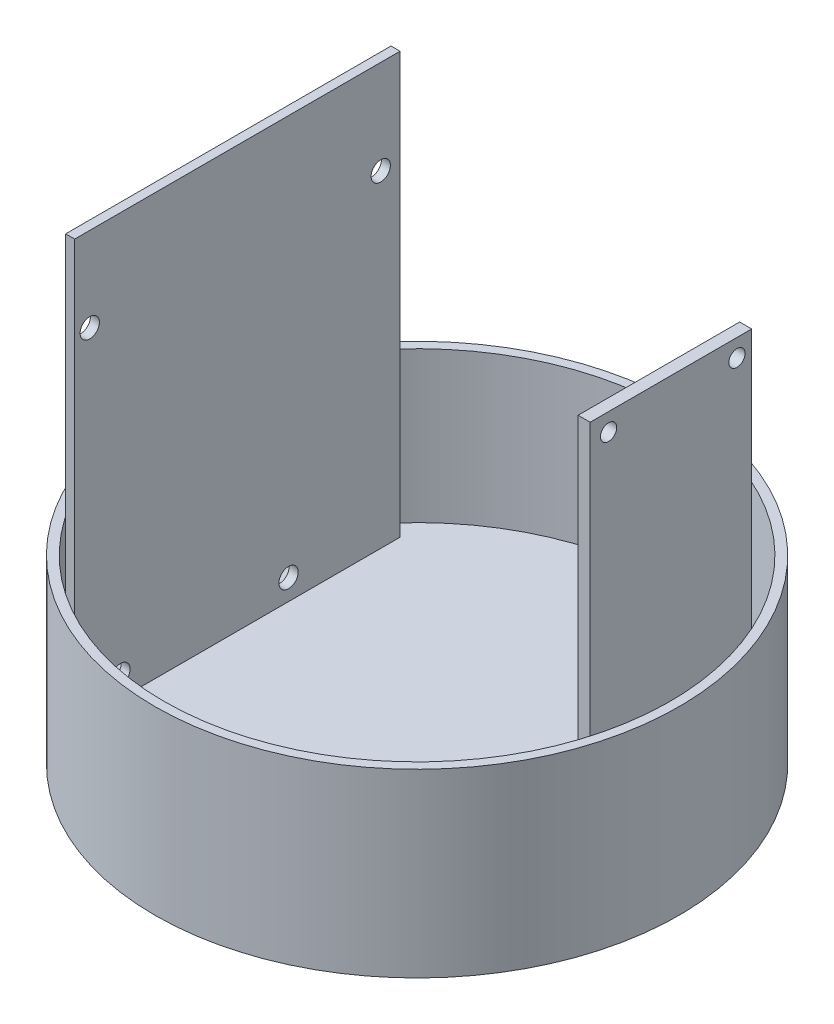
ISO-10303-21;
HEADER;
FILE_DESCRIPTION(('STEP AP214'),'2;1');
FILE_NAME('part.step','',(''),(''),'','','');
FILE_SCHEMA(('AUTOMOTIVE_DESIGN { 1 0 10303 214 1 1 1 1 }'));
ENDSEC;
DATA;
#1=APPLICATION_CONTEXT('core data for automotive mechanical design processes');
#2=APPLICATION_PROTOCOL_DEFINITION('international standard','automotive_design',2000,#1);
#3=PRODUCT_CONTEXT('',#1,'mechanical');
#4=PRODUCT('Part','Part','',(#3));
#5=PRODUCT_RELATED_PRODUCT_CATEGORY('part','',(#4));
#6=PRODUCT_DEFINITION_FORMATION('','',#4);
#7=PRODUCT_DEFINITION_CONTEXT('part definition',#1,'design');
#8=PRODUCT_DEFINITION('design','',#6,#7);
#9=PRODUCT_DEFINITION_SHAPE('','',#8);
#10=(LENGTH_UNIT() NAMED_UNIT(*) SI_UNIT(.MILLI.,.METRE.));
#11=(NAMED_UNIT(*) PLANE_ANGLE_UNIT() SI_UNIT($,.RADIAN.));
#12=(NAMED_UNIT(*) SI_UNIT($,.STERADIAN.) SOLID_ANGLE_UNIT());
#13=UNCERTAINTY_MEASURE_WITH_UNIT(LENGTH_MEASURE(1.E-05),#10,'distance_accuracy_value','');
#14=(GEOMETRIC_REPRESENTATION_CONTEXT(3) GLOBAL_UNCERTAINTY_ASSIGNED_CONTEXT((#13)) GLOBAL_UNIT_ASSIGNED_CONTEXT((#10,
#11,#12)) REPRESENTATION_CONTEXT('',''));
#15=CARTESIAN_POINT('',(0.,0.,0.));
#16=DIRECTION('',(0.,0.,1.));
#17=DIRECTION('',(1.,0.,0.));
#18=AXIS2_PLACEMENT_3D('',#15,#16,#17);
#19=CARTESIAN_POINT('',(0.,4.99999999999999,0.));
#20=DIRECTION('',(0.,1.,0.));
#21=DIRECTION('',(0.,0.,1.));
#22=AXIS2_PLACEMENT_3D('',#19,#20,#21);
#23=PLANE('',#22);
#24=DIRECTION('',(0.,0.,-1.));
#25=VECTOR('',#24,1.);
#26=CARTESIAN_POINT('',(30.9383053559725,4.99999999999999,-24.6003340299148));
#27=LINE('',#26,#25);
#28=CARTESIAN_POINT('',(30.9383053559726,4.99999999999999,2.20655244063472));
#29=VERTEX_POINT('',#28);
#30=CARTESIAN_POINT('',(30.9383053559725,4.99999999999999,-24.6003340299148));
#31=VERTEX_POINT('',#30);
#32=EDGE_CURVE('E144',#29,#31,#27,.T.);
#33=ORIENTED_EDGE('',*,*,#32,.F.);
#34=DIRECTION('',(-1.,0.,0.));
#35=VECTOR('',#34,1.);
#36=CARTESIAN_POINT('',(43.501,4.99999999999999,2.20655244063472));
#37=LINE('',#36,#35);
#38=CARTESIAN_POINT('',(28.9383053559725,4.99999999999999,2.20655244063472));
#39=VERTEX_POINT('',#38);
#40=EDGE_CURVE('E120',#29,#39,#37,.T.);
#41=ORIENTED_EDGE('',*,*,#40,.T.);
#42=DIRECTION('',(0.,0.,1.));
#43=VECTOR('',#42,1.);
#44=CARTESIAN_POINT('',(28.9383053559725,4.99999999999999,-24.6003340299148));
#45=LINE('',#44,#43);
#46=CARTESIAN_POINT('',(28.9383053559725,4.99999999999999,-24.6003340299148));
#47=VERTEX_POINT('',#46);
#48=EDGE_CURVE('E128',#47,#39,#45,.T.);
#49=ORIENTED_EDGE('',*,*,#48,.F.);
#50=DIRECTION('',(-1.,0.,0.));
#51=VECTOR('',#50,1.);
#52=CARTESIAN_POINT('',(30.9383053559725,4.99999999999999,-24.6003340299148));
#53=LINE('',#52,#51);
#54=EDGE_CURVE('E147',#31,#47,#53,.T.);
#55=ORIENTED_EDGE('',*,*,#54,.F.);
#56=EDGE_LOOP('',(#33,#41,#49,#55));
#57=FACE_BOUND('',#56,.T.);
#58=CARTESIAN_POINT('',(0.,4.99999999999999,0.));
#59=DIRECTION('',(0.,1.,0.));
#60=DIRECTION('',(0.,0.,1.));
#61=AXIS2_PLACEMENT_3D('',#58,#59,#60);
#62=CIRCLE('',#61,42.);
#63=CARTESIAN_POINT('',(0.,4.99999999999999,42.));
#64=VERTEX_POINT('',#63);
#65=EDGE_CURVE('E232',#64,#64,#62,.T.);
#66=ORIENTED_EDGE('',*,*,#65,.T.);
#67=EDGE_LOOP('',(#66));
#68=FACE_BOUND('',#67,.T.);
#69=DIRECTION('',(1.,0.,0.));
#70=VECTOR('',#69,1.);
#71=CARTESIAN_POINT('',(-30.5050252601889,4.99999999999999,27.8201260331686));
#72=LINE('',#71,#70);
#73=CARTESIAN_POINT('',(-30.5050252601889,4.99999999999999,27.8201260331686));
#74=VERTEX_POINT('',#73);
#75=CARTESIAN_POINT('',(-29.0050252601889,4.99999999999999,27.8201260331686));
#76=VERTEX_POINT('',#75);
#77=EDGE_CURVE('E208',#74,#76,#72,.T.);
#78=ORIENTED_EDGE('',*,*,#77,.F.);
#79=DIRECTION('',(0.,0.,1.));
#80=VECTOR('',#79,1.);
#81=CARTESIAN_POINT('',(-30.5050252601889,4.99999999999999,-26.1798739668314));
#82=LINE('',#81,#80);
#83=CARTESIAN_POINT('',(-30.5050252601889,4.99999999999999,-26.1798739668314));
#84=VERTEX_POINT('',#83);
#85=EDGE_CURVE('E204',#84,#74,#82,.T.);
#86=ORIENTED_EDGE('',*,*,#85,.F.);
#87=DIRECTION('',(-1.,0.,0.));
#88=VECTOR('',#87,1.);
#89=CARTESIAN_POINT('',(-30.5050252601889,4.99999999999999,-26.1798739668314));
#90=LINE('',#89,#88);
#91=CARTESIAN_POINT('',(-29.0050252601889,4.99999999999999,-26.1798739668314));
#92=VERTEX_POINT('',#91);
#93=EDGE_CURVE('E216',#92,#84,#90,.T.);
#94=ORIENTED_EDGE('',*,*,#93,.F.);
#95=DIRECTION('',(0.,0.,-1.));
#96=VECTOR('',#95,1.);
#97=CARTESIAN_POINT('',(-29.0050252601889,4.99999999999999,-26.1798739668314));
#98=LINE('',#97,#96);
#99=EDGE_CURVE('E212',#76,#92,#98,.T.);
#100=ORIENTED_EDGE('',*,*,#99,.F.);
#101=EDGE_LOOP('',(#78,#86,#94,#100));
#102=FACE_BOUND('',#101,.T.);
#103=ADVANCED_FACE('F45',(#57,#68,#102),#23,.T.);
#104=CARTESIAN_POINT('',(0.,30.,0.));
#105=DIRECTION('',(0.,-1.,0.));
#106=DIRECTION('',(0.,0.,-1.));
#107=AXIS2_PLACEMENT_3D('',#104,#105,#106);
#108=CYLINDRICAL_SURFACE('',#107,43.5);
#109=CARTESIAN_POINT('',(0.,30.,0.));
#110=DIRECTION('',(0.,1.,0.));
#111=DIRECTION('',(0.,0.,1.));
#112=AXIS2_PLACEMENT_3D('',#109,#110,#111);
#113=CIRCLE('',#112,43.5);
#114=CARTESIAN_POINT('',(0.,30.,43.5));
#115=VERTEX_POINT('',#114);
#116=EDGE_CURVE('E11',#115,#115,#113,.T.);
#117=ORIENTED_EDGE('',*,*,#116,.F.);
#118=EDGE_LOOP('',(#117));
#119=FACE_BOUND('',#118,.T.);
#120=CARTESIAN_POINT('',(0.,0.,0.));
#121=DIRECTION('',(0.,1.,0.));
#122=DIRECTION('',(0.,0.,1.));
#123=AXIS2_PLACEMENT_3D('',#120,#121,#122);
#124=CIRCLE('',#123,43.5);
#125=CARTESIAN_POINT('',(0.,0.,43.5));
#126=VERTEX_POINT('',#125);
#127=EDGE_CURVE('E55',#126,#126,#124,.T.);
#128=ORIENTED_EDGE('',*,*,#127,.T.);
#129=EDGE_LOOP('',(#128));
#130=FACE_BOUND('',#129,.T.);
#131=ADVANCED_FACE('F47',(#119,#130),#108,.T.);
#132=CARTESIAN_POINT('',(0.,30.,0.));
#133=DIRECTION('',(0.,1.,0.));
#134=DIRECTION('',(0.,0.,1.));
#135=AXIS2_PLACEMENT_3D('',#132,#133,#134);
#136=PLANE('',#135);
#137=CARTESIAN_POINT('',(0.,30.,0.));
#138=DIRECTION('',(0.,1.,0.));
#139=DIRECTION('',(0.,0.,1.));
#140=AXIS2_PLACEMENT_3D('',#137,#138,#139);
#141=CIRCLE('',#140,42.);
#142=CARTESIAN_POINT('',(0.,30.,42.));
#143=VERTEX_POINT('',#142);
#144=EDGE_CURVE('E49',#143,#143,#141,.T.);
#145=ORIENTED_EDGE('',*,*,#144,.F.);
#146=EDGE_LOOP('',(#145));
#147=FACE_BOUND('',#146,.T.);
#148=ORIENTED_EDGE('',*,*,#116,.T.);
#149=EDGE_LOOP('',(#148));
#150=FACE_BOUND('',#149,.T.);
#151=ADVANCED_FACE('F246',(#147,#150),#136,.T.);
#152=CARTESIAN_POINT('',(0.,0.,0.));
#153=DIRECTION('',(0.,1.,0.));
#154=DIRECTION('',(0.,0.,1.));
#155=AXIS2_PLACEMENT_3D('',#152,#153,#154);
#156=PLANE('',#155);
#157=ORIENTED_EDGE('',*,*,#127,.F.);
#158=EDGE_LOOP('',(#157));
#159=FACE_BOUND('',#158,.T.);
#160=ADVANCED_FACE('F249',(#159),#156,.F.);
#161=CARTESIAN_POINT('',(0.,4.99999999999999,0.));
#162=DIRECTION('',(0.,1.,0.));
#163=DIRECTION('',(0.,0.,1.));
#164=AXIS2_PLACEMENT_3D('',#161,#162,#163);
#165=CYLINDRICAL_SURFACE('',#164,42.);
#166=ORIENTED_EDGE('',*,*,#144,.T.);
#167=EDGE_LOOP('',(#166));
#168=FACE_BOUND('',#167,.T.);
#169=ORIENTED_EDGE('',*,*,#65,.F.);
#170=EDGE_LOOP('',(#169));
#171=FACE_BOUND('',#170,.T.);
#172=ADVANCED_FACE('F243',(#168,#171),#165,.F.);
#173=CARTESIAN_POINT('',(-30.5050252601889,85.,-26.1798739668314));
#174=DIRECTION('',(1.,0.,0.));
#175=DIRECTION('',(0.,0.,-1.));
#176=AXIS2_PLACEMENT_3D('',#173,#174,#175);
#177=PLANE('',#176);
#178=CARTESIAN_POINT('',(-30.5050252601889,60.8606572002365,25.3201260331693));
#179=DIRECTION('',(1.,0.,0.));
#180=DIRECTION('',(0.,0.,-1.));
#181=AXIS2_PLACEMENT_3D('',#178,#179,#180);
#182=CIRCLE('',#181,1.6);
#183=CARTESIAN_POINT('',(-30.5050252601889,60.8606572002365,23.7201260331694));
#184=VERTEX_POINT('',#183);
#185=EDGE_CURVE('E165',#184,#184,#182,.F.);
#186=ORIENTED_EDGE('',*,*,#185,.F.);
#187=EDGE_LOOP('',(#186));
#188=FACE_BOUND('',#187,.T.);
#189=CARTESIAN_POINT('',(-30.5050252601889,59.2606572002372,-22.9798739668307));
#190=DIRECTION('',(1.,0.,0.));
#191=DIRECTION('',(0.,0.,-1.));
#192=AXIS2_PLACEMENT_3D('',#189,#190,#191);
#193=CIRCLE('',#192,1.6);
#194=CARTESIAN_POINT('',(-30.5050252601889,59.2606572002372,-24.5798739668307));
#195=VERTEX_POINT('',#194);
#196=EDGE_CURVE('E170',#195,#195,#193,.F.);
#197=ORIENTED_EDGE('',*,*,#196,.F.);
#198=EDGE_LOOP('',(#197));
#199=FACE_BOUND('',#198,.T.);
#200=CARTESIAN_POINT('',(-30.5050252601889,8.46065720023696,-7.67987396683139));
#201=DIRECTION('',(1.,0.,0.));
#202=DIRECTION('',(0.,0.,-1.));
#203=AXIS2_PLACEMENT_3D('',#200,#201,#202);
#204=CIRCLE('',#203,1.59999999999999);
#205=CARTESIAN_POINT('',(-30.5050252601889,8.46065720023696,-9.27987396683138));
#206=VERTEX_POINT('',#205);
#207=EDGE_CURVE('E174',#206,#206,#204,.F.);
#208=ORIENTED_EDGE('',*,*,#207,.F.);
#209=EDGE_LOOP('',(#208));
#210=FACE_BOUND('',#209,.T.);
#211=CARTESIAN_POINT('',(-30.5050252601889,8.46065720023656,20.2201260331686));
#212=DIRECTION('',(1.,0.,0.));
#213=DIRECTION('',(0.,0.,-1.));
#214=AXIS2_PLACEMENT_3D('',#211,#212,#213);
#215=CIRCLE('',#214,1.59999999999999);
#216=CARTESIAN_POINT('',(-30.5050252601889,8.46065720023656,18.6201260331686));
#217=VERTEX_POINT('',#216);
#218=EDGE_CURVE('E182',#217,#217,#215,.F.);
#219=ORIENTED_EDGE('',*,*,#218,.F.);
#220=EDGE_LOOP('',(#219));
#221=FACE_BOUND('',#220,.T.);
#222=DIRECTION('',(0.,-1.,0.));
#223=VECTOR('',#222,1.);
#224=CARTESIAN_POINT('',(-30.5050252601889,85.,27.8201260331686));
#225=LINE('',#224,#223);
#226=CARTESIAN_POINT('',(-30.5050252601889,74.8606572002371,27.8201260331686));
#227=VERTEX_POINT('',#226);
#228=EDGE_CURVE('E229',#227,#74,#225,.T.);
#229=ORIENTED_EDGE('',*,*,#228,.F.);
#230=DIRECTION('',(0.,0.,-1.));
#231=VECTOR('',#230,1.);
#232=CARTESIAN_POINT('',(-30.5050252601889,74.8606572002371,-26.1798739668314));
#233=LINE('',#232,#231);
#234=CARTESIAN_POINT('',(-30.5050252601889,74.8606572002371,-26.1798739668314));
#235=VERTEX_POINT('',#234);
#236=EDGE_CURVE('E198',#227,#235,#233,.T.);
#237=ORIENTED_EDGE('',*,*,#236,.T.);
#238=DIRECTION('',(0.,-1.,0.));
#239=VECTOR('',#238,1.);
#240=CARTESIAN_POINT('',(-30.5050252601889,85.,-26.1798739668314));
#241=LINE('',#240,#239);
#242=EDGE_CURVE('E220',#235,#84,#241,.T.);
#243=ORIENTED_EDGE('',*,*,#242,.T.);
#244=ORIENTED_EDGE('',*,*,#85,.T.);
#245=EDGE_LOOP('',(#229,#237,#243,#244));
#246=FACE_BOUND('',#245,.T.);
#247=ADVANCED_FACE('F268',(#188,#199,#210,#221,#246),#177,.F.);
#248=CARTESIAN_POINT('',(-30.5050252601889,85.,27.8201260331686));
#249=DIRECTION('',(0.,0.,-1.));
#250=DIRECTION('',(-1.,0.,0.));
#251=AXIS2_PLACEMENT_3D('',#248,#249,#250);
#252=PLANE('',#251);
#253=DIRECTION('',(0.,-1.,0.));
#254=VECTOR('',#253,1.);
#255=CARTESIAN_POINT('',(-29.0050252601889,85.,27.8201260331686));
#256=LINE('',#255,#254);
#257=CARTESIAN_POINT('',(-29.0050252601889,74.8606572002371,27.8201260331686));
#258=VERTEX_POINT('',#257);
#259=EDGE_CURVE('E226',#258,#76,#256,.T.);
#260=ORIENTED_EDGE('',*,*,#259,.F.);
#261=DIRECTION('',(1.,0.,0.));
#262=VECTOR('',#261,1.);
#263=CARTESIAN_POINT('',(-43.5,74.8606572002371,27.8201260331686));
#264=LINE('',#263,#262);
#265=EDGE_CURVE('E194',#227,#258,#264,.T.);
#266=ORIENTED_EDGE('',*,*,#265,.F.);
#267=ORIENTED_EDGE('',*,*,#228,.T.);
#268=ORIENTED_EDGE('',*,*,#77,.T.);
#269=EDGE_LOOP('',(#260,#266,#267,#268));
#270=FACE_BOUND('',#269,.T.);
#271=ADVANCED_FACE('F289',(#270),#252,.F.);
#272=CARTESIAN_POINT('',(-29.0050252601889,85.,-26.1798739668314));
#273=DIRECTION('',(-1.,0.,0.));
#274=DIRECTION('',(0.,0.,1.));
#275=AXIS2_PLACEMENT_3D('',#272,#273,#274);
#276=PLANE('',#275);
#277=CARTESIAN_POINT('',(-29.0050252601889,60.8606572002365,25.3201260331693));
#278=DIRECTION('',(1.,0.,0.));
#279=DIRECTION('',(0.,0.,-1.));
#280=AXIS2_PLACEMENT_3D('',#277,#278,#279);
#281=CIRCLE('',#280,1.6);
#282=CARTESIAN_POINT('',(-29.0050252601889,60.8606572002365,23.7201260331693));
#283=VERTEX_POINT('',#282);
#284=EDGE_CURVE('E161',#283,#283,#281,.T.);
#285=ORIENTED_EDGE('',*,*,#284,.F.);
#286=EDGE_LOOP('',(#285));
#287=FACE_BOUND('',#286,.T.);
#288=CARTESIAN_POINT('',(-29.0050252601889,59.2606572002372,-22.9798739668307));
#289=DIRECTION('',(1.,0.,0.));
#290=DIRECTION('',(0.,0.,-1.));
#291=AXIS2_PLACEMENT_3D('',#288,#289,#290);
#292=CIRCLE('',#291,1.6);
#293=CARTESIAN_POINT('',(-29.0050252601889,59.2606572002372,-24.5798739668307));
#294=VERTEX_POINT('',#293);
#295=EDGE_CURVE('E166',#294,#294,#292,.T.);
#296=ORIENTED_EDGE('',*,*,#295,.F.);
#297=EDGE_LOOP('',(#296));
#298=FACE_BOUND('',#297,.T.);
#299=CARTESIAN_POINT('',(-29.0050252601889,8.46065720023696,-7.67987396683139));
#300=DIRECTION('',(1.,0.,0.));
#301=DIRECTION('',(0.,0.,-1.));
#302=AXIS2_PLACEMENT_3D('',#299,#300,#301);
#303=CIRCLE('',#302,1.59999999999999);
#304=CARTESIAN_POINT('',(-29.0050252601889,8.46065720023696,-9.27987396683138));
#305=VERTEX_POINT('',#304);
#306=EDGE_CURVE('E178',#305,#305,#303,.T.);
#307=ORIENTED_EDGE('',*,*,#306,.F.);
#308=EDGE_LOOP('',(#307));
#309=FACE_BOUND('',#308,.T.);
#310=CARTESIAN_POINT('',(-29.0050252601889,8.46065720023656,20.2201260331686));
#311=DIRECTION('',(1.,0.,0.));
#312=DIRECTION('',(0.,0.,-1.));
#313=AXIS2_PLACEMENT_3D('',#310,#311,#312);
#314=CIRCLE('',#313,1.59999999999999);
#315=CARTESIAN_POINT('',(-29.0050252601889,8.46065720023656,18.6201260331686));
#316=VERTEX_POINT('',#315);
#317=EDGE_CURVE('E160',#316,#316,#314,.T.);
#318=ORIENTED_EDGE('',*,*,#317,.F.);
#319=EDGE_LOOP('',(#318));
#320=FACE_BOUND('',#319,.T.);
#321=DIRECTION('',(0.,-1.,0.));
#322=VECTOR('',#321,1.);
#323=CARTESIAN_POINT('',(-29.0050252601889,85.,-26.1798739668314));
#324=LINE('',#323,#322);
#325=CARTESIAN_POINT('',(-29.0050252601889,74.8606572002371,-26.1798739668314));
#326=VERTEX_POINT('',#325);
#327=EDGE_CURVE('E223',#326,#92,#324,.T.);
#328=ORIENTED_EDGE('',*,*,#327,.F.);
#329=DIRECTION('',(0.,0.,-1.));
#330=VECTOR('',#329,1.);
#331=CARTESIAN_POINT('',(-29.0050252601889,74.8606572002371,27.8201260331686));
#332=LINE('',#331,#330);
#333=EDGE_CURVE('E71',#258,#326,#332,.T.);
#334=ORIENTED_EDGE('',*,*,#333,.F.);
#335=ORIENTED_EDGE('',*,*,#259,.T.);
#336=ORIENTED_EDGE('',*,*,#99,.T.);
#337=EDGE_LOOP('',(#328,#334,#335,#336));
#338=FACE_BOUND('',#337,.T.);
#339=ADVANCED_FACE('F293',(#287,#298,#309,#320,#338),#276,.F.);
#340=CARTESIAN_POINT('',(-30.5050252601889,85.,-26.1798739668314));
#341=DIRECTION('',(0.,0.,1.));
#342=DIRECTION('',(1.,0.,0.));
#343=AXIS2_PLACEMENT_3D('',#340,#341,#342);
#344=PLANE('',#343);
#345=ORIENTED_EDGE('',*,*,#242,.F.);
#346=DIRECTION('',(1.,0.,0.));
#347=VECTOR('',#346,1.);
#348=CARTESIAN_POINT('',(-43.5,74.8606572002371,-26.1798739668314));
#349=LINE('',#348,#347);
#350=EDGE_CURVE('E195',#235,#326,#349,.T.);
#351=ORIENTED_EDGE('',*,*,#350,.T.);
#352=ORIENTED_EDGE('',*,*,#327,.T.);
#353=ORIENTED_EDGE('',*,*,#93,.T.);
#354=EDGE_LOOP('',(#345,#351,#352,#353));
#355=FACE_BOUND('',#354,.T.);
#356=ADVANCED_FACE('F299',(#355),#344,.F.);
#357=CARTESIAN_POINT('',(-43.5,74.8606572002371,27.8201260331686));
#358=DIRECTION('',(0.,-1.,0.));
#359=DIRECTION('',(0.,0.,-1.));
#360=AXIS2_PLACEMENT_3D('',#357,#358,#359);
#361=PLANE('',#360);
#362=ORIENTED_EDGE('',*,*,#265,.T.);
#363=ORIENTED_EDGE('',*,*,#333,.T.);
#364=ORIENTED_EDGE('',*,*,#350,.F.);
#365=ORIENTED_EDGE('',*,*,#236,.F.);
#366=EDGE_LOOP('',(#362,#363,#364,#365));
#367=FACE_BOUND('',#366,.T.);
#368=ADVANCED_FACE('F303',(#367),#361,.F.);
#369=CARTESIAN_POINT('',(-43.501,8.46065720023656,20.2201260331686));
#370=DIRECTION('',(1.,0.,0.));
#371=DIRECTION('',(0.,0.,-1.));
#372=AXIS2_PLACEMENT_3D('',#369,#370,#371);
#373=CYLINDRICAL_SURFACE('',#372,1.59999999999999);
#374=ORIENTED_EDGE('',*,*,#317,.T.);
#375=EDGE_LOOP('',(#374));
#376=FACE_BOUND('',#375,.T.);
#377=ORIENTED_EDGE('',*,*,#218,.T.);
#378=EDGE_LOOP('',(#377));
#379=FACE_BOUND('',#378,.T.);
#380=ADVANCED_FACE('F312',(#376,#379),#373,.F.);
#381=CARTESIAN_POINT('',(-43.501,8.46065720023696,-7.67987396683139));
#382=DIRECTION('',(1.,0.,0.));
#383=DIRECTION('',(0.,0.,-1.));
#384=AXIS2_PLACEMENT_3D('',#381,#382,#383);
#385=CYLINDRICAL_SURFACE('',#384,1.59999999999999);
#386=ORIENTED_EDGE('',*,*,#306,.T.);
#387=EDGE_LOOP('',(#386));
#388=FACE_BOUND('',#387,.T.);
#389=ORIENTED_EDGE('',*,*,#207,.T.);
#390=EDGE_LOOP('',(#389));
#391=FACE_BOUND('',#390,.T.);
#392=ADVANCED_FACE('F333',(#388,#391),#385,.F.);
#393=CARTESIAN_POINT('',(-43.501,59.2606572002372,-22.9798739668307));
#394=DIRECTION('',(1.,0.,0.));
#395=DIRECTION('',(0.,0.,-1.));
#396=AXIS2_PLACEMENT_3D('',#393,#394,#395);
#397=CYLINDRICAL_SURFACE('',#396,1.6);
#398=ORIENTED_EDGE('',*,*,#295,.T.);
#399=EDGE_LOOP('',(#398));
#400=FACE_BOUND('',#399,.T.);
#401=ORIENTED_EDGE('',*,*,#196,.T.);
#402=EDGE_LOOP('',(#401));
#403=FACE_BOUND('',#402,.T.);
#404=ADVANCED_FACE('F342',(#400,#403),#397,.F.);
#405=CARTESIAN_POINT('',(-43.501,60.8606572002365,25.3201260331693));
#406=DIRECTION('',(1.,0.,0.));
#407=DIRECTION('',(0.,0.,-1.));
#408=AXIS2_PLACEMENT_3D('',#405,#406,#407);
#409=CYLINDRICAL_SURFACE('',#408,1.6);
#410=ORIENTED_EDGE('',*,*,#284,.T.);
#411=EDGE_LOOP('',(#410));
#412=FACE_BOUND('',#411,.T.);
#413=ORIENTED_EDGE('',*,*,#185,.T.);
#414=EDGE_LOOP('',(#413));
#415=FACE_BOUND('',#414,.T.);
#416=ADVANCED_FACE('F351',(#412,#415),#409,.F.);
#417=CARTESIAN_POINT('',(30.9383053559725,72.,-24.6003340299148));
#418=DIRECTION('',(-1.,0.,0.));
#419=DIRECTION('',(0.,0.,1.));
#420=AXIS2_PLACEMENT_3D('',#417,#418,#419);
#421=PLANE('',#420);
#422=CARTESIAN_POINT('',(30.9383053559725,62.7500000000001,-0.850334029914798));
#423=DIRECTION('',(-1.,0.,0.));
#424=DIRECTION('',(0.,0.,1.));
#425=AXIS2_PLACEMENT_3D('',#422,#423,#424);
#426=CIRCLE('',#425,1.35000000000001);
#427=CARTESIAN_POINT('',(30.9383053559725,62.7500000000001,0.499665970085209));
#428=VERTEX_POINT('',#427);
#429=EDGE_CURVE('E457',#428,#428,#426,.F.);
#430=ORIENTED_EDGE('',*,*,#429,.F.);
#431=EDGE_LOOP('',(#430));
#432=FACE_BOUND('',#431,.T.);
#433=CARTESIAN_POINT('',(30.9383053559725,7.45000000000009,-22.1503340299148));
#434=DIRECTION('',(-1.,0.,0.));
#435=DIRECTION('',(0.,0.,1.));
#436=AXIS2_PLACEMENT_3D('',#433,#434,#435);
#437=CIRCLE('',#436,1.35);
#438=CARTESIAN_POINT('',(30.9383053559725,7.45000000000009,-20.8003340299148));
#439=VERTEX_POINT('',#438);
#440=EDGE_CURVE('E461',#439,#439,#437,.F.);
#441=ORIENTED_EDGE('',*,*,#440,.F.);
#442=EDGE_LOOP('',(#441));
#443=FACE_BOUND('',#442,.T.);
#444=CARTESIAN_POINT('',(30.9383053559725,7.45000000000009,-0.850334029914798));
#445=DIRECTION('',(-1.,0.,0.));
#446=DIRECTION('',(0.,0.,1.));
#447=AXIS2_PLACEMENT_3D('',#444,#445,#446);
#448=CIRCLE('',#447,1.35);
#449=CARTESIAN_POINT('',(30.9383053559725,7.45000000000009,0.499665970085205));
#450=VERTEX_POINT('',#449);
#451=EDGE_CURVE('E465',#450,#450,#448,.F.);
#452=ORIENTED_EDGE('',*,*,#451,.F.);
#453=EDGE_LOOP('',(#452));
#454=FACE_BOUND('',#453,.T.);
#455=CARTESIAN_POINT('',(30.9383053559725,62.7500000000001,-22.1503340299148));
#456=DIRECTION('',(-1.,0.,0.));
#457=DIRECTION('',(0.,0.,1.));
#458=AXIS2_PLACEMENT_3D('',#455,#456,#457);
#459=CIRCLE('',#458,1.35000000000002);
#460=CARTESIAN_POINT('',(30.9383053559725,62.7500000000001,-20.8003340299148));
#461=VERTEX_POINT('',#460);
#462=EDGE_CURVE('E469',#461,#461,#459,.F.);
#463=ORIENTED_EDGE('',*,*,#462,.F.);
#464=EDGE_LOOP('',(#463));
#465=FACE_BOUND('',#464,.T.);
#466=DIRECTION('',(0.,0.,-1.));
#467=VECTOR('',#466,1.);
#468=CARTESIAN_POINT('',(30.9383053559725,65.7019377887025,-24.6003340299148));
#469=LINE('',#468,#467);
#470=CARTESIAN_POINT('',(30.9383053559725,65.7019377887025,2.20655244063472));
#471=VERTEX_POINT('',#470);
#472=CARTESIAN_POINT('',(30.9383053559725,65.7019377887025,-24.6003340299148));
#473=VERTEX_POINT('',#472);
#474=EDGE_CURVE('E138',#471,#473,#469,.T.);
#475=ORIENTED_EDGE('',*,*,#474,.F.);
#476=DIRECTION('',(0.,1.,0.));
#477=VECTOR('',#476,1.);
#478=CARTESIAN_POINT('',(30.9383053559725,4.99999999999999,2.20655244063472));
#479=LINE('',#478,#477);
#480=EDGE_CURVE('E63',#29,#471,#479,.T.);
#481=ORIENTED_EDGE('',*,*,#480,.F.);
#482=ORIENTED_EDGE('',*,*,#32,.T.);
#483=DIRECTION('',(0.,-1.,0.));
#484=VECTOR('',#483,1.);
#485=CARTESIAN_POINT('',(30.9383053559725,72.,-24.6003340299148));
#486=LINE('',#485,#484);
#487=EDGE_CURVE('E156',#473,#31,#486,.T.);
#488=ORIENTED_EDGE('',*,*,#487,.F.);
#489=EDGE_LOOP('',(#475,#481,#482,#488));
#490=FACE_BOUND('',#489,.T.);
#491=ADVANCED_FACE('F359',(#432,#443,#454,#465,#490),#421,.F.);
#492=CARTESIAN_POINT('',(30.9383053559725,72.,-24.6003340299148));
#493=DIRECTION('',(0.,0.,1.));
#494=DIRECTION('',(1.,0.,0.));
#495=AXIS2_PLACEMENT_3D('',#492,#493,#494);
#496=PLANE('',#495);
#497=DIRECTION('',(0.,-1.,0.));
#498=VECTOR('',#497,1.);
#499=CARTESIAN_POINT('',(28.9383053559725,72.,-24.6003340299148));
#500=LINE('',#499,#498);
#501=CARTESIAN_POINT('',(28.9383053559725,65.7019377887025,-24.6003340299148));
#502=VERTEX_POINT('',#501);
#503=EDGE_CURVE('E153',#502,#47,#500,.T.);
#504=ORIENTED_EDGE('',*,*,#503,.F.);
#505=DIRECTION('',(-1.,0.,0.));
#506=VECTOR('',#505,1.);
#507=CARTESIAN_POINT('',(43.501,65.7019377887025,-24.6003340299148));
#508=LINE('',#507,#506);
#509=EDGE_CURVE('E133',#473,#502,#508,.T.);
#510=ORIENTED_EDGE('',*,*,#509,.F.);
#511=ORIENTED_EDGE('',*,*,#487,.T.);
#512=ORIENTED_EDGE('',*,*,#54,.T.);
#513=EDGE_LOOP('',(#504,#510,#511,#512));
#514=FACE_BOUND('',#513,.T.);
#515=ADVANCED_FACE('F366',(#514),#496,.F.);
#516=CARTESIAN_POINT('',(28.9383053559725,72.,-24.6003340299148));
#517=DIRECTION('',(1.,0.,0.));
#518=DIRECTION('',(0.,0.,-1.));
#519=AXIS2_PLACEMENT_3D('',#516,#517,#518);
#520=PLANE('',#519);
#521=CARTESIAN_POINT('',(28.9383053559725,62.7500000000001,-0.850334029914798));
#522=DIRECTION('',(-1.,0.,0.));
#523=DIRECTION('',(0.,0.,1.));
#524=AXIS2_PLACEMENT_3D('',#521,#522,#523);
#525=CIRCLE('',#524,1.35000000000001);
#526=CARTESIAN_POINT('',(28.9383053559725,62.7500000000001,0.499665970085209));
#527=VERTEX_POINT('',#526);
#528=EDGE_CURVE('E481',#527,#527,#525,.T.);
#529=ORIENTED_EDGE('',*,*,#528,.F.);
#530=EDGE_LOOP('',(#529));
#531=FACE_BOUND('',#530,.T.);
#532=CARTESIAN_POINT('',(28.9383053559725,7.45000000000009,-22.1503340299148));
#533=DIRECTION('',(-1.,0.,0.));
#534=DIRECTION('',(0.,0.,1.));
#535=AXIS2_PLACEMENT_3D('',#532,#533,#534);
#536=CIRCLE('',#535,1.35);
#537=CARTESIAN_POINT('',(28.9383053559725,7.45000000000009,-20.8003340299148));
#538=VERTEX_POINT('',#537);
#539=EDGE_CURVE('E484',#538,#538,#536,.T.);
#540=ORIENTED_EDGE('',*,*,#539,.F.);
#541=EDGE_LOOP('',(#540));
#542=FACE_BOUND('',#541,.T.);
#543=CARTESIAN_POINT('',(28.9383053559725,7.45000000000009,-0.850334029914798));
#544=DIRECTION('',(-1.,0.,0.));
#545=DIRECTION('',(0.,0.,1.));
#546=AXIS2_PLACEMENT_3D('',#543,#544,#545);
#547=CIRCLE('',#546,1.35);
#548=CARTESIAN_POINT('',(28.9383053559725,7.45000000000009,0.499665970085205));
#549=VERTEX_POINT('',#548);
#550=EDGE_CURVE('E494',#549,#549,#547,.T.);
#551=ORIENTED_EDGE('',*,*,#550,.F.);
#552=EDGE_LOOP('',(#551));
#553=FACE_BOUND('',#552,.T.);
#554=CARTESIAN_POINT('',(28.9383053559725,62.7500000000001,-22.1503340299148));
#555=DIRECTION('',(-1.,0.,0.));
#556=DIRECTION('',(0.,0.,1.));
#557=AXIS2_PLACEMENT_3D('',#554,#555,#556);
#558=CIRCLE('',#557,1.35000000000002);
#559=CARTESIAN_POINT('',(28.9383053559725,62.7500000000001,-20.8003340299148));
#560=VERTEX_POINT('',#559);
#561=EDGE_CURVE('E475',#560,#560,#558,.T.);
#562=ORIENTED_EDGE('',*,*,#561,.F.);
#563=EDGE_LOOP('',(#562));
#564=FACE_BOUND('',#563,.T.);
#565=ORIENTED_EDGE('',*,*,#48,.T.);
#566=DIRECTION('',(0.,-1.,0.));
#567=VECTOR('',#566,1.);
#568=CARTESIAN_POINT('',(28.9383053559725,4.99999999999999,2.20655244063472));
#569=LINE('',#568,#567);
#570=CARTESIAN_POINT('',(28.9383053559725,65.7019377887025,2.20655244063472));
#571=VERTEX_POINT('',#570);
#572=EDGE_CURVE('E114',#571,#39,#569,.T.);
#573=ORIENTED_EDGE('',*,*,#572,.F.);
#574=DIRECTION('',(0.,0.,1.));
#575=VECTOR('',#574,1.);
#576=CARTESIAN_POINT('',(28.9383053559725,65.7019377887025,-24.6003340299148));
#577=LINE('',#576,#575);
#578=EDGE_CURVE('E125',#502,#571,#577,.T.);
#579=ORIENTED_EDGE('',*,*,#578,.F.);
#580=ORIENTED_EDGE('',*,*,#503,.T.);
#581=EDGE_LOOP('',(#565,#573,#579,#580));
#582=FACE_BOUND('',#581,.T.);
#583=ADVANCED_FACE('F124',(#531,#542,#553,#564,#582),#520,.F.);
#584=CARTESIAN_POINT('',(43.501,65.7019377887025,-24.6003340299148));
#585=DIRECTION('',(0.,-1.,0.));
#586=DIRECTION('',(0.,0.,-1.));
#587=AXIS2_PLACEMENT_3D('',#584,#585,#586);
#588=PLANE('',#587);
#589=ORIENTED_EDGE('',*,*,#578,.T.);
#590=DIRECTION('',(-1.,0.,0.));
#591=VECTOR('',#590,1.);
#592=CARTESIAN_POINT('',(43.501,65.7019377887025,2.20655244063472));
#593=LINE('',#592,#591);
#594=EDGE_CURVE('E111',#471,#571,#593,.T.);
#595=ORIENTED_EDGE('',*,*,#594,.F.);
#596=ORIENTED_EDGE('',*,*,#474,.T.);
#597=ORIENTED_EDGE('',*,*,#509,.T.);
#598=EDGE_LOOP('',(#589,#595,#596,#597));
#599=FACE_BOUND('',#598,.T.);
#600=ADVANCED_FACE('F131',(#599),#588,.F.);
#601=CARTESIAN_POINT('',(43.501,4.99999999999999,2.20655244063472));
#602=DIRECTION('',(0.,0.,-1.));
#603=DIRECTION('',(-1.,0.,0.));
#604=AXIS2_PLACEMENT_3D('',#601,#602,#603);
#605=PLANE('',#604);
#606=ORIENTED_EDGE('',*,*,#480,.T.);
#607=ORIENTED_EDGE('',*,*,#594,.T.);
#608=ORIENTED_EDGE('',*,*,#572,.T.);
#609=ORIENTED_EDGE('',*,*,#40,.F.);
#610=EDGE_LOOP('',(#606,#607,#608,#609));
#611=FACE_BOUND('',#610,.T.);
#612=ADVANCED_FACE('F113',(#611),#605,.F.);
#613=CARTESIAN_POINT('',(43.501,62.7500000000001,-22.1503340299148));
#614=DIRECTION('',(-1.,0.,0.));
#615=DIRECTION('',(0.,0.,1.));
#616=AXIS2_PLACEMENT_3D('',#613,#614,#615);
#617=CYLINDRICAL_SURFACE('',#616,1.35000000000002);
#618=ORIENTED_EDGE('',*,*,#561,.T.);
#619=EDGE_LOOP('',(#618));
#620=FACE_BOUND('',#619,.T.);
#621=ORIENTED_EDGE('',*,*,#462,.T.);
#622=EDGE_LOOP('',(#621));
#623=FACE_BOUND('',#622,.T.);
#624=ADVANCED_FACE('F408',(#620,#623),#617,.F.);
#625=CARTESIAN_POINT('',(43.501,7.45000000000009,-0.850334029914798));
#626=DIRECTION('',(-1.,0.,0.));
#627=DIRECTION('',(0.,0.,1.));
#628=AXIS2_PLACEMENT_3D('',#625,#626,#627);
#629=CYLINDRICAL_SURFACE('',#628,1.35);
#630=ORIENTED_EDGE('',*,*,#550,.T.);
#631=EDGE_LOOP('',(#630));
#632=FACE_BOUND('',#631,.T.);
#633=ORIENTED_EDGE('',*,*,#451,.T.);
#634=EDGE_LOOP('',(#633));
#635=FACE_BOUND('',#634,.T.);
#636=ADVANCED_FACE('F416',(#632,#635),#629,.F.);
#637=CARTESIAN_POINT('',(43.501,7.45000000000009,-22.1503340299148));
#638=DIRECTION('',(-1.,0.,0.));
#639=DIRECTION('',(0.,0.,1.));
#640=AXIS2_PLACEMENT_3D('',#637,#638,#639);
#641=CYLINDRICAL_SURFACE('',#640,1.35);
#642=ORIENTED_EDGE('',*,*,#539,.T.);
#643=EDGE_LOOP('',(#642));
#644=FACE_BOUND('',#643,.T.);
#645=ORIENTED_EDGE('',*,*,#440,.T.);
#646=EDGE_LOOP('',(#645));
#647=FACE_BOUND('',#646,.T.);
#648=ADVANCED_FACE('F426',(#644,#647),#641,.F.);
#649=CARTESIAN_POINT('',(43.501,62.7500000000001,-0.850334029914798));
#650=DIRECTION('',(-1.,0.,0.));
#651=DIRECTION('',(0.,0.,1.));
#652=AXIS2_PLACEMENT_3D('',#649,#650,#651);
#653=CYLINDRICAL_SURFACE('',#652,1.35000000000001);
#654=ORIENTED_EDGE('',*,*,#528,.T.);
#655=EDGE_LOOP('',(#654));
#656=FACE_BOUND('',#655,.T.);
#657=ORIENTED_EDGE('',*,*,#429,.T.);
#658=EDGE_LOOP('',(#657));
#659=FACE_BOUND('',#658,.T.);
#660=ADVANCED_FACE('F436',(#656,#659),#653,.F.);
#661=CLOSED_SHELL('',(#103,#131,#151,#160,#172,#247,#271,#339,#356,#368,#380,#392,#404,#416,
#491,#515,#583,#600,#612,#624,#636,#648,#660));
#662=MANIFOLD_SOLID_BREP('B2',#661);
#663=ADVANCED_BREP_SHAPE_REPRESENTATION('',(#18,#662),#14);
#664=SHAPE_DEFINITION_REPRESENTATION(#9,#663);
ENDSEC;
END-ISO-10303-21;
